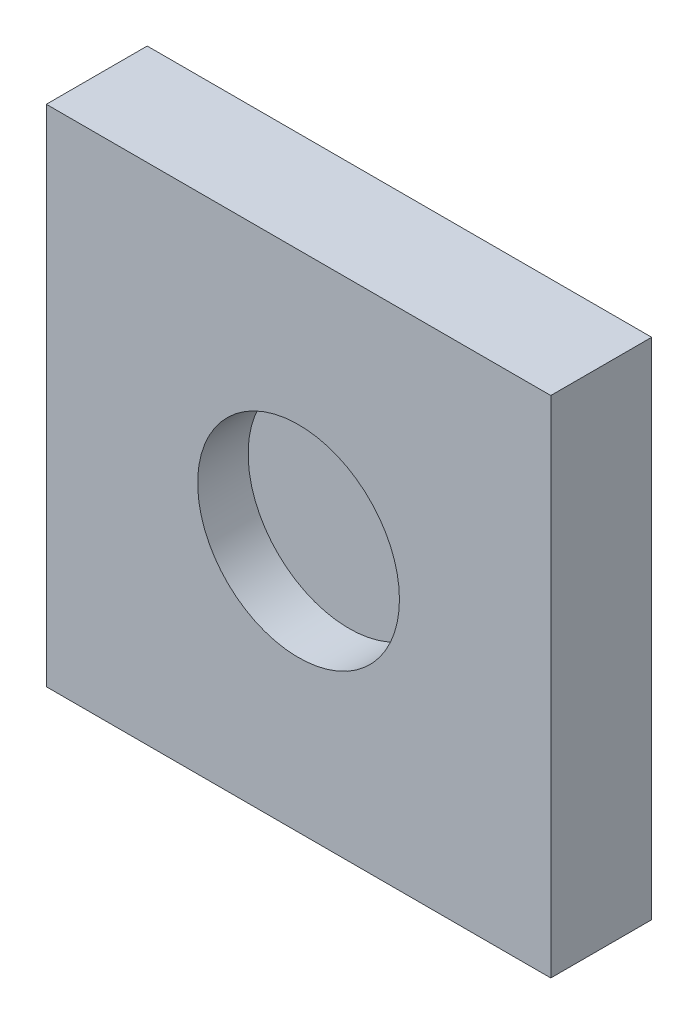
ISO-10303-21;
HEADER;
FILE_DESCRIPTION(('STEP AP214'),'2;1');
FILE_NAME('part.step','',(''),(''),'','','');
FILE_SCHEMA(('AUTOMOTIVE_DESIGN { 1 0 10303 214 1 1 1 1 }'));
ENDSEC;
DATA;
#1=APPLICATION_CONTEXT('core data for automotive mechanical design processes');
#2=APPLICATION_PROTOCOL_DEFINITION('international standard','automotive_design',2000,#1);
#3=PRODUCT_CONTEXT('',#1,'mechanical');
#4=PRODUCT('Part','Part','',(#3));
#5=PRODUCT_RELATED_PRODUCT_CATEGORY('part','',(#4));
#6=PRODUCT_DEFINITION_FORMATION('','',#4);
#7=PRODUCT_DEFINITION_CONTEXT('part definition',#1,'design');
#8=PRODUCT_DEFINITION('design','',#6,#7);
#9=PRODUCT_DEFINITION_SHAPE('','',#8);
#10=(LENGTH_UNIT() NAMED_UNIT(*) SI_UNIT(.MILLI.,.METRE.));
#11=(NAMED_UNIT(*) PLANE_ANGLE_UNIT() SI_UNIT($,.RADIAN.));
#12=(NAMED_UNIT(*) SI_UNIT($,.STERADIAN.) SOLID_ANGLE_UNIT());
#13=UNCERTAINTY_MEASURE_WITH_UNIT(LENGTH_MEASURE(1.E-05),#10,'distance_accuracy_value','');
#14=(GEOMETRIC_REPRESENTATION_CONTEXT(3) GLOBAL_UNCERTAINTY_ASSIGNED_CONTEXT((#13)) GLOBAL_UNIT_ASSIGNED_CONTEXT((#10,
#11,#12)) REPRESENTATION_CONTEXT('',''));
#15=CARTESIAN_POINT('',(0.,0.,0.));
#16=DIRECTION('',(0.,0.,1.));
#17=DIRECTION('',(1.,0.,0.));
#18=AXIS2_PLACEMENT_3D('',#15,#16,#17);
#19=CARTESIAN_POINT('',(50.,-50.,20.));
#20=DIRECTION('',(0.,-1.,0.));
#21=DIRECTION('',(1.,0.,0.));
#22=AXIS2_PLACEMENT_3D('',#19,#20,#21);
#23=PLANE('',#22);
#24=DIRECTION('',(-1.,0.,0.));
#25=VECTOR('',#24,1.);
#26=CARTESIAN_POINT('',(50.,-50.,0.));
#27=LINE('',#26,#25);
#28=CARTESIAN_POINT('',(50.,-50.,0.));
#29=VERTEX_POINT('',#28);
#30=CARTESIAN_POINT('',(-50.,-50.,0.));
#31=VERTEX_POINT('',#30);
#32=EDGE_CURVE('E110',#29,#31,#27,.T.);
#33=ORIENTED_EDGE('',*,*,#32,.F.);
#34=DIRECTION('',(0.,0.,-1.));
#35=VECTOR('',#34,1.);
#36=CARTESIAN_POINT('',(50.,-50.,20.));
#37=LINE('',#36,#35);
#38=CARTESIAN_POINT('',(50.,-50.,20.));
#39=VERTEX_POINT('',#38);
#40=EDGE_CURVE('E11',#39,#29,#37,.T.);
#41=ORIENTED_EDGE('',*,*,#40,.F.);
#42=DIRECTION('',(-1.,0.,0.));
#43=VECTOR('',#42,1.);
#44=CARTESIAN_POINT('',(50.,-50.,20.));
#45=LINE('',#44,#43);
#46=CARTESIAN_POINT('',(-50.,-50.,20.));
#47=VERTEX_POINT('',#46);
#48=EDGE_CURVE('E101',#39,#47,#45,.T.);
#49=ORIENTED_EDGE('',*,*,#48,.T.);
#50=DIRECTION('',(0.,0.,-1.));
#51=VECTOR('',#50,1.);
#52=CARTESIAN_POINT('',(-50.,-50.,20.));
#53=LINE('',#52,#51);
#54=EDGE_CURVE('E42',#47,#31,#53,.T.);
#55=ORIENTED_EDGE('',*,*,#54,.T.);
#56=EDGE_LOOP('',(#33,#41,#49,#55));
#57=FACE_BOUND('',#56,.T.);
#58=ADVANCED_FACE('F39',(#57),#23,.T.);
#59=CARTESIAN_POINT('',(50.,50.,20.));
#60=DIRECTION('',(1.,0.,0.));
#61=DIRECTION('',(0.,1.,0.));
#62=AXIS2_PLACEMENT_3D('',#59,#60,#61);
#63=PLANE('',#62);
#64=DIRECTION('',(0.,-1.,0.));
#65=VECTOR('',#64,1.);
#66=CARTESIAN_POINT('',(50.,50.,0.));
#67=LINE('',#66,#65);
#68=CARTESIAN_POINT('',(50.,50.,0.));
#69=VERTEX_POINT('',#68);
#70=EDGE_CURVE('E104',#69,#29,#67,.T.);
#71=ORIENTED_EDGE('',*,*,#70,.F.);
#72=DIRECTION('',(0.,0.,-1.));
#73=VECTOR('',#72,1.);
#74=CARTESIAN_POINT('',(50.,50.,20.));
#75=LINE('',#74,#73);
#76=CARTESIAN_POINT('',(50.,50.,20.));
#77=VERTEX_POINT('',#76);
#78=EDGE_CURVE('E49',#77,#69,#75,.T.);
#79=ORIENTED_EDGE('',*,*,#78,.F.);
#80=DIRECTION('',(0.,-1.,0.));
#81=VECTOR('',#80,1.);
#82=CARTESIAN_POINT('',(50.,50.,20.));
#83=LINE('',#82,#81);
#84=EDGE_CURVE('E88',#77,#39,#83,.T.);
#85=ORIENTED_EDGE('',*,*,#84,.T.);
#86=ORIENTED_EDGE('',*,*,#40,.T.);
#87=EDGE_LOOP('',(#71,#79,#85,#86));
#88=FACE_BOUND('',#87,.T.);
#89=ADVANCED_FACE('F127',(#88),#63,.T.);
#90=CARTESIAN_POINT('',(50.,50.,20.));
#91=DIRECTION('',(0.,-1.,0.));
#92=DIRECTION('',(1.,0.,0.));
#93=AXIS2_PLACEMENT_3D('',#90,#91,#92);
#94=PLANE('',#93);
#95=DIRECTION('',(-1.,0.,0.));
#96=VECTOR('',#95,1.);
#97=CARTESIAN_POINT('',(50.,50.,0.));
#98=LINE('',#97,#96);
#99=CARTESIAN_POINT('',(-50.,50.,0.));
#100=VERTEX_POINT('',#99);
#101=EDGE_CURVE('E94',#69,#100,#98,.T.);
#102=ORIENTED_EDGE('',*,*,#101,.T.);
#103=DIRECTION('',(0.,0.,-1.));
#104=VECTOR('',#103,1.);
#105=CARTESIAN_POINT('',(-50.,50.,20.));
#106=LINE('',#105,#104);
#107=CARTESIAN_POINT('',(-50.,50.,20.));
#108=VERTEX_POINT('',#107);
#109=EDGE_CURVE('E92',#108,#100,#106,.T.);
#110=ORIENTED_EDGE('',*,*,#109,.F.);
#111=DIRECTION('',(-1.,0.,0.));
#112=VECTOR('',#111,1.);
#113=CARTESIAN_POINT('',(50.,50.,20.));
#114=LINE('',#113,#112);
#115=EDGE_CURVE('E85',#77,#108,#114,.T.);
#116=ORIENTED_EDGE('',*,*,#115,.F.);
#117=ORIENTED_EDGE('',*,*,#78,.T.);
#118=EDGE_LOOP('',(#102,#110,#116,#117));
#119=FACE_BOUND('',#118,.T.);
#120=ADVANCED_FACE('F93',(#119),#94,.F.);
#121=CARTESIAN_POINT('',(-50.,50.,20.));
#122=DIRECTION('',(1.,0.,0.));
#123=DIRECTION('',(0.,1.,0.));
#124=AXIS2_PLACEMENT_3D('',#121,#122,#123);
#125=PLANE('',#124);
#126=DIRECTION('',(0.,-1.,0.));
#127=VECTOR('',#126,1.);
#128=CARTESIAN_POINT('',(-50.,50.,0.));
#129=LINE('',#128,#127);
#130=EDGE_CURVE('E114',#100,#31,#129,.T.);
#131=ORIENTED_EDGE('',*,*,#130,.T.);
#132=ORIENTED_EDGE('',*,*,#54,.F.);
#133=DIRECTION('',(0.,-1.,0.));
#134=VECTOR('',#133,1.);
#135=CARTESIAN_POINT('',(-50.,50.,20.));
#136=LINE('',#135,#134);
#137=EDGE_CURVE('E82',#108,#47,#136,.T.);
#138=ORIENTED_EDGE('',*,*,#137,.F.);
#139=ORIENTED_EDGE('',*,*,#109,.T.);
#140=EDGE_LOOP('',(#131,#132,#138,#139));
#141=FACE_BOUND('',#140,.T.);
#142=ADVANCED_FACE('F99',(#141),#125,.F.);
#143=CARTESIAN_POINT('',(0.,0.,20.));
#144=DIRECTION('',(0.,0.,1.));
#145=DIRECTION('',(1.,0.,0.));
#146=AXIS2_PLACEMENT_3D('',#143,#144,#145);
#147=PLANE('',#146);
#148=CARTESIAN_POINT('',(0.,0.,20.));
#149=DIRECTION('',(0.,0.,1.));
#150=DIRECTION('',(1.,0.,0.));
#151=AXIS2_PLACEMENT_3D('',#148,#149,#150);
#152=CIRCLE('',#151,20.);
#153=CARTESIAN_POINT('',(20.,0.,20.));
#154=VERTEX_POINT('',#153);
#155=EDGE_CURVE('E159',#154,#154,#152,.T.);
#156=ORIENTED_EDGE('',*,*,#155,.F.);
#157=EDGE_LOOP('',(#156));
#158=FACE_BOUND('',#157,.T.);
#159=ORIENTED_EDGE('',*,*,#48,.F.);
#160=ORIENTED_EDGE('',*,*,#84,.F.);
#161=ORIENTED_EDGE('',*,*,#115,.T.);
#162=ORIENTED_EDGE('',*,*,#137,.T.);
#163=EDGE_LOOP('',(#159,#160,#161,#162));
#164=FACE_BOUND('',#163,.T.);
#165=ADVANCED_FACE('F87',(#158,#164),#147,.T.);
#166=CARTESIAN_POINT('',(0.,0.,0.));
#167=DIRECTION('',(0.,0.,1.));
#168=DIRECTION('',(1.,0.,0.));
#169=AXIS2_PLACEMENT_3D('',#166,#167,#168);
#170=PLANE('',#169);
#171=ORIENTED_EDGE('',*,*,#32,.T.);
#172=ORIENTED_EDGE('',*,*,#130,.F.);
#173=ORIENTED_EDGE('',*,*,#101,.F.);
#174=ORIENTED_EDGE('',*,*,#70,.T.);
#175=EDGE_LOOP('',(#171,#172,#173,#174));
#176=FACE_BOUND('',#175,.T.);
#177=ADVANCED_FACE('F126',(#176),#170,.F.);
#178=CARTESIAN_POINT('',(0.,0.,10.));
#179=DIRECTION('',(0.,0.,1.));
#180=DIRECTION('',(1.,0.,0.));
#181=AXIS2_PLACEMENT_3D('',#178,#179,#180);
#182=CYLINDRICAL_SURFACE('',#181,20.);
#183=CARTESIAN_POINT('',(0.,0.,10.));
#184=DIRECTION('',(0.,0.,1.));
#185=DIRECTION('',(1.,0.,0.));
#186=AXIS2_PLACEMENT_3D('',#183,#184,#185);
#187=CIRCLE('',#186,20.);
#188=CARTESIAN_POINT('',(20.,0.,10.));
#189=VERTEX_POINT('',#188);
#190=EDGE_CURVE('E115',#189,#189,#187,.T.);
#191=ORIENTED_EDGE('',*,*,#190,.F.);
#192=EDGE_LOOP('',(#191));
#193=FACE_BOUND('',#192,.T.);
#194=ORIENTED_EDGE('',*,*,#155,.T.);
#195=EDGE_LOOP('',(#194));
#196=FACE_BOUND('',#195,.T.);
#197=ADVANCED_FACE('F145',(#193,#196),#182,.F.);
#198=CARTESIAN_POINT('',(0.,0.,10.));
#199=DIRECTION('',(0.,0.,1.));
#200=DIRECTION('',(1.,0.,0.));
#201=AXIS2_PLACEMENT_3D('',#198,#199,#200);
#202=PLANE('',#201);
#203=ORIENTED_EDGE('',*,*,#190,.T.);
#204=EDGE_LOOP('',(#203));
#205=FACE_BOUND('',#204,.T.);
#206=ADVANCED_FACE('F150',(#205),#202,.T.);
#207=CLOSED_SHELL('',(#58,#89,#120,#142,#165,#177,#197,#206));
#208=MANIFOLD_SOLID_BREP('B2',#207);
#209=ADVANCED_BREP_SHAPE_REPRESENTATION('',(#18,#208),#14);
#210=SHAPE_DEFINITION_REPRESENTATION(#9,#209);
ENDSEC;
END-ISO-10303-21;
